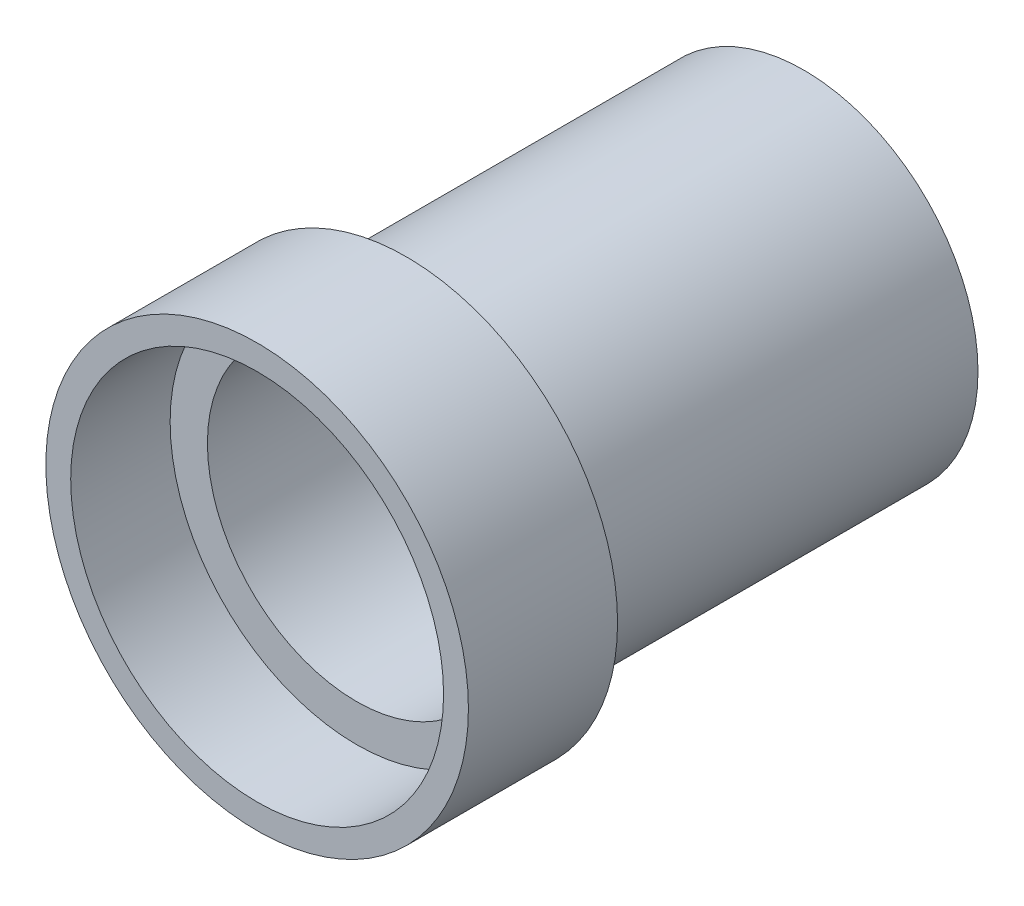
ISO-10303-21;
HEADER;
FILE_DESCRIPTION(('STEP AP214'),'2;1');
FILE_NAME('part.step','',(''),(''),'','','');
FILE_SCHEMA(('AUTOMOTIVE_DESIGN { 1 0 10303 214 1 1 1 1 }'));
ENDSEC;
DATA;
#1=APPLICATION_CONTEXT('core data for automotive mechanical design processes');
#2=APPLICATION_PROTOCOL_DEFINITION('international standard','automotive_design',2000,#1);
#3=PRODUCT_CONTEXT('',#1,'mechanical');
#4=PRODUCT('Part','Part','',(#3));
#5=PRODUCT_RELATED_PRODUCT_CATEGORY('part','',(#4));
#6=PRODUCT_DEFINITION_FORMATION('','',#4);
#7=PRODUCT_DEFINITION_CONTEXT('part definition',#1,'design');
#8=PRODUCT_DEFINITION('design','',#6,#7);
#9=PRODUCT_DEFINITION_SHAPE('','',#8);
#10=(LENGTH_UNIT() NAMED_UNIT(*) SI_UNIT(.MILLI.,.METRE.));
#11=(NAMED_UNIT(*) PLANE_ANGLE_UNIT() SI_UNIT($,.RADIAN.));
#12=(NAMED_UNIT(*) SI_UNIT($,.STERADIAN.) SOLID_ANGLE_UNIT());
#13=UNCERTAINTY_MEASURE_WITH_UNIT(LENGTH_MEASURE(1.E-05),#10,'distance_accuracy_value','');
#14=(GEOMETRIC_REPRESENTATION_CONTEXT(3) GLOBAL_UNCERTAINTY_ASSIGNED_CONTEXT((#13)) GLOBAL_UNIT_ASSIGNED_CONTEXT((#10,
#11,#12)) REPRESENTATION_CONTEXT('',''));
#15=CARTESIAN_POINT('',(0.,0.,0.));
#16=DIRECTION('',(0.,0.,1.));
#17=DIRECTION('',(1.,0.,0.));
#18=AXIS2_PLACEMENT_3D('',#15,#16,#17);
#19=CARTESIAN_POINT('',(0.,0.,16.));
#20=DIRECTION('',(0.,0.,-1.));
#21=DIRECTION('',(-1.,0.,0.));
#22=AXIS2_PLACEMENT_3D('',#19,#20,#21);
#23=CYLINDRICAL_SURFACE('',#22,7.);
#24=CARTESIAN_POINT('',(0.,0.,16.));
#25=DIRECTION('',(0.,0.,1.));
#26=DIRECTION('',(1.,0.,0.));
#27=AXIS2_PLACEMENT_3D('',#24,#25,#26);
#28=CIRCLE('',#27,7.);
#29=CARTESIAN_POINT('',(7.,0.,16.));
#30=VERTEX_POINT('',#29);
#31=EDGE_CURVE('E10',#30,#30,#28,.T.);
#32=ORIENTED_EDGE('',*,*,#31,.F.);
#33=EDGE_LOOP('',(#32));
#34=FACE_BOUND('',#33,.T.);
#35=CARTESIAN_POINT('',(0.,0.,0.));
#36=DIRECTION('',(0.,0.,1.));
#37=DIRECTION('',(1.,0.,0.));
#38=AXIS2_PLACEMENT_3D('',#35,#36,#37);
#39=CIRCLE('',#38,7.);
#40=CARTESIAN_POINT('',(7.,0.,0.));
#41=VERTEX_POINT('',#40);
#42=EDGE_CURVE('E37',#41,#41,#39,.T.);
#43=ORIENTED_EDGE('',*,*,#42,.T.);
#44=EDGE_LOOP('',(#43));
#45=FACE_BOUND('',#44,.T.);
#46=ADVANCED_FACE('F30',(#34,#45),#23,.T.);
#47=CARTESIAN_POINT('',(0.,0.,0.));
#48=DIRECTION('',(0.,0.,1.));
#49=DIRECTION('',(1.,0.,0.));
#50=AXIS2_PLACEMENT_3D('',#47,#48,#49);
#51=PLANE('',#50);
#52=CARTESIAN_POINT('',(0.,0.,0.));
#53=DIRECTION('',(0.,0.,-1.));
#54=DIRECTION('',(-1.,0.,0.));
#55=AXIS2_PLACEMENT_3D('',#52,#53,#54);
#56=CIRCLE('',#55,6.);
#57=CARTESIAN_POINT('',(-6.,0.,0.));
#58=VERTEX_POINT('',#57);
#59=EDGE_CURVE('E55',#58,#58,#56,.T.);
#60=ORIENTED_EDGE('',*,*,#59,.F.);
#61=EDGE_LOOP('',(#60));
#62=FACE_BOUND('',#61,.T.);
#63=ORIENTED_EDGE('',*,*,#42,.F.);
#64=EDGE_LOOP('',(#63));
#65=FACE_BOUND('',#64,.T.);
#66=ADVANCED_FACE('F90',(#62,#65),#51,.F.);
#67=CARTESIAN_POINT('',(0.,0.,16.));
#68=DIRECTION('',(0.,0.,1.));
#69=DIRECTION('',(1.,0.,0.));
#70=AXIS2_PLACEMENT_3D('',#67,#68,#69);
#71=PLANE('',#70);
#72=CARTESIAN_POINT('',(0.,0.,16.));
#73=DIRECTION('',(0.,0.,1.));
#74=DIRECTION('',(1.,0.,0.));
#75=AXIS2_PLACEMENT_3D('',#72,#73,#74);
#76=CIRCLE('',#75,8.5);
#77=CARTESIAN_POINT('',(8.5,0.,16.));
#78=VERTEX_POINT('',#77);
#79=EDGE_CURVE('E44',#78,#78,#76,.T.);
#80=ORIENTED_EDGE('',*,*,#79,.F.);
#81=EDGE_LOOP('',(#80));
#82=FACE_BOUND('',#81,.T.);
#83=ORIENTED_EDGE('',*,*,#31,.T.);
#84=EDGE_LOOP('',(#83));
#85=FACE_BOUND('',#84,.T.);
#86=ADVANCED_FACE('F85',(#82,#85),#71,.F.);
#87=CARTESIAN_POINT('',(0.,0.,22.));
#88=DIRECTION('',(0.,0.,-1.));
#89=DIRECTION('',(-1.,0.,0.));
#90=AXIS2_PLACEMENT_3D('',#87,#88,#89);
#91=CYLINDRICAL_SURFACE('',#90,8.5);
#92=CARTESIAN_POINT('',(0.,0.,22.));
#93=DIRECTION('',(0.,0.,1.));
#94=DIRECTION('',(1.,0.,0.));
#95=AXIS2_PLACEMENT_3D('',#92,#93,#94);
#96=CIRCLE('',#95,8.5);
#97=CARTESIAN_POINT('',(8.5,0.,22.));
#98=VERTEX_POINT('',#97);
#99=EDGE_CURVE('E42',#98,#98,#96,.T.);
#100=ORIENTED_EDGE('',*,*,#99,.F.);
#101=EDGE_LOOP('',(#100));
#102=FACE_BOUND('',#101,.T.);
#103=ORIENTED_EDGE('',*,*,#79,.T.);
#104=EDGE_LOOP('',(#103));
#105=FACE_BOUND('',#104,.T.);
#106=ADVANCED_FACE('F79',(#102,#105),#91,.T.);
#107=CARTESIAN_POINT('',(0.,0.,22.));
#108=DIRECTION('',(0.,0.,1.));
#109=DIRECTION('',(1.,0.,0.));
#110=AXIS2_PLACEMENT_3D('',#107,#108,#109);
#111=PLANE('',#110);
#112=CARTESIAN_POINT('',(0.,0.,22.));
#113=DIRECTION('',(0.,0.,1.));
#114=DIRECTION('',(1.,0.,0.));
#115=AXIS2_PLACEMENT_3D('',#112,#113,#114);
#116=CIRCLE('',#115,7.5);
#117=CARTESIAN_POINT('',(7.5,0.,22.));
#118=VERTEX_POINT('',#117);
#119=EDGE_CURVE('E50',#118,#118,#116,.T.);
#120=ORIENTED_EDGE('',*,*,#119,.F.);
#121=EDGE_LOOP('',(#120));
#122=FACE_BOUND('',#121,.T.);
#123=ORIENTED_EDGE('',*,*,#99,.T.);
#124=EDGE_LOOP('',(#123));
#125=FACE_BOUND('',#124,.T.);
#126=ADVANCED_FACE('F73',(#122,#125),#111,.T.);
#127=CARTESIAN_POINT('',(0.,0.,18.));
#128=DIRECTION('',(0.,0.,1.));
#129=DIRECTION('',(1.,0.,0.));
#130=AXIS2_PLACEMENT_3D('',#127,#128,#129);
#131=CYLINDRICAL_SURFACE('',#130,7.5);
#132=CARTESIAN_POINT('',(0.,0.,18.));
#133=DIRECTION('',(0.,0.,1.));
#134=DIRECTION('',(1.,0.,0.));
#135=AXIS2_PLACEMENT_3D('',#132,#133,#134);
#136=CIRCLE('',#135,7.5);
#137=CARTESIAN_POINT('',(7.5,0.,18.));
#138=VERTEX_POINT('',#137);
#139=EDGE_CURVE('E47',#138,#138,#136,.T.);
#140=ORIENTED_EDGE('',*,*,#139,.F.);
#141=EDGE_LOOP('',(#140));
#142=FACE_BOUND('',#141,.T.);
#143=ORIENTED_EDGE('',*,*,#119,.T.);
#144=EDGE_LOOP('',(#143));
#145=FACE_BOUND('',#144,.T.);
#146=ADVANCED_FACE('F67',(#142,#145),#131,.F.);
#147=CARTESIAN_POINT('',(0.,0.,18.));
#148=DIRECTION('',(0.,0.,1.));
#149=DIRECTION('',(1.,0.,0.));
#150=AXIS2_PLACEMENT_3D('',#147,#148,#149);
#151=PLANE('',#150);
#152=CARTESIAN_POINT('',(0.,0.,18.));
#153=DIRECTION('',(0.,0.,1.));
#154=DIRECTION('',(1.,0.,0.));
#155=AXIS2_PLACEMENT_3D('',#152,#153,#154);
#156=CIRCLE('',#155,6.);
#157=CARTESIAN_POINT('',(6.,0.,18.));
#158=VERTEX_POINT('',#157);
#159=EDGE_CURVE('E33',#158,#158,#156,.T.);
#160=ORIENTED_EDGE('',*,*,#159,.F.);
#161=EDGE_LOOP('',(#160));
#162=FACE_BOUND('',#161,.T.);
#163=ORIENTED_EDGE('',*,*,#139,.T.);
#164=EDGE_LOOP('',(#163));
#165=FACE_BOUND('',#164,.T.);
#166=ADVANCED_FACE('F64',(#162,#165),#151,.T.);
#167=CARTESIAN_POINT('',(0.,0.,25.));
#168=DIRECTION('',(0.,0.,-1.));
#169=DIRECTION('',(-1.,0.,0.));
#170=AXIS2_PLACEMENT_3D('',#167,#168,#169);
#171=CYLINDRICAL_SURFACE('',#170,6.);
#172=ORIENTED_EDGE('',*,*,#159,.T.);
#173=EDGE_LOOP('',(#172));
#174=FACE_BOUND('',#173,.T.);
#175=ORIENTED_EDGE('',*,*,#59,.T.);
#176=EDGE_LOOP('',(#175));
#177=FACE_BOUND('',#176,.T.);
#178=ADVANCED_FACE('F62',(#174,#177),#171,.F.);
#179=CLOSED_SHELL('',(#46,#66,#86,#106,#126,#146,#166,#178));
#180=MANIFOLD_SOLID_BREP('B2',#179);
#181=ADVANCED_BREP_SHAPE_REPRESENTATION('',(#18,#180),#14);
#182=SHAPE_DEFINITION_REPRESENTATION(#9,#181);
ENDSEC;
END-ISO-10303-21;
